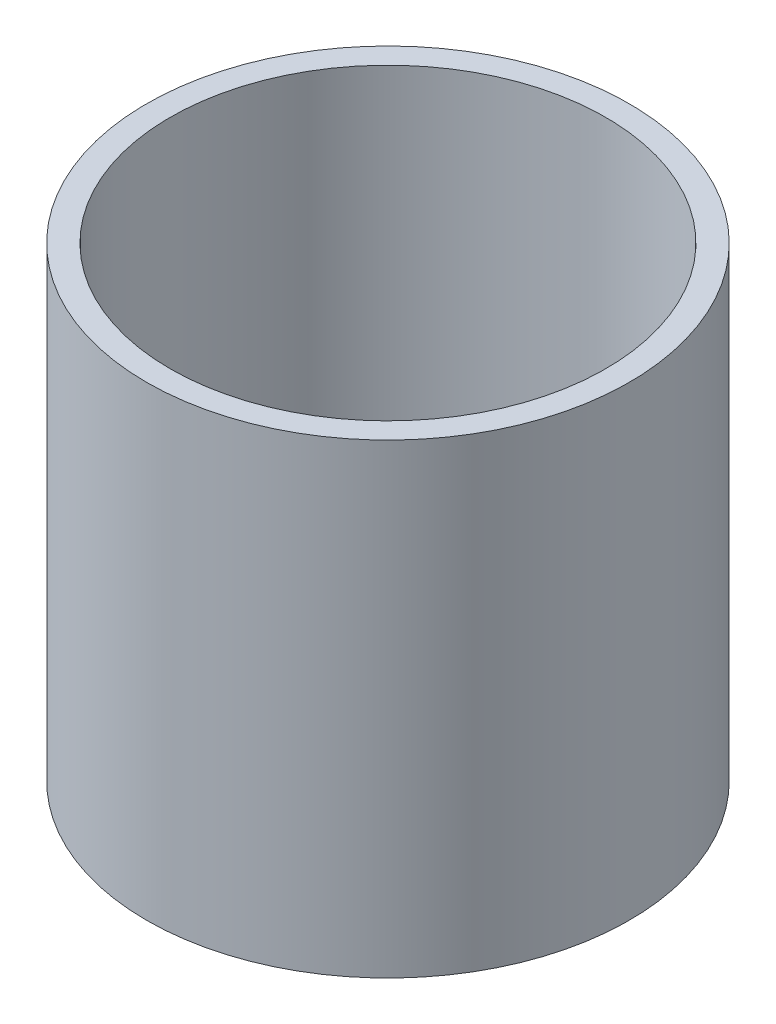
ISO-10303-21;
HEADER;
FILE_DESCRIPTION(('STEP AP214'),'2;1');
FILE_NAME('part.step','',(''),(''),'','','');
FILE_SCHEMA(('AUTOMOTIVE_DESIGN { 1 0 10303 214 1 1 1 1 }'));
ENDSEC;
DATA;
#1=APPLICATION_CONTEXT('core data for automotive mechanical design processes');
#2=APPLICATION_PROTOCOL_DEFINITION('international standard','automotive_design',2000,#1);
#3=PRODUCT_CONTEXT('',#1,'mechanical');
#4=PRODUCT('Part','Part','',(#3));
#5=PRODUCT_RELATED_PRODUCT_CATEGORY('part','',(#4));
#6=PRODUCT_DEFINITION_FORMATION('','',#4);
#7=PRODUCT_DEFINITION_CONTEXT('part definition',#1,'design');
#8=PRODUCT_DEFINITION('design','',#6,#7);
#9=PRODUCT_DEFINITION_SHAPE('','',#8);
#10=(LENGTH_UNIT() NAMED_UNIT(*) SI_UNIT(.MILLI.,.METRE.));
#11=(NAMED_UNIT(*) PLANE_ANGLE_UNIT() SI_UNIT($,.RADIAN.));
#12=(NAMED_UNIT(*) SI_UNIT($,.STERADIAN.) SOLID_ANGLE_UNIT());
#13=UNCERTAINTY_MEASURE_WITH_UNIT(LENGTH_MEASURE(1.E-05),#10,'distance_accuracy_value','');
#14=(GEOMETRIC_REPRESENTATION_CONTEXT(3) GLOBAL_UNCERTAINTY_ASSIGNED_CONTEXT((#13)) GLOBAL_UNIT_ASSIGNED_CONTEXT((#10,
#11,#12)) REPRESENTATION_CONTEXT('',''));
#15=CARTESIAN_POINT('',(0.,0.,0.));
#16=DIRECTION('',(0.,0.,1.));
#17=DIRECTION('',(1.,0.,0.));
#18=AXIS2_PLACEMENT_3D('',#15,#16,#17);
#19=CARTESIAN_POINT('',(0.,82.0479972284988,0.));
#20=DIRECTION('',(0.,-1.,0.));
#21=DIRECTION('',(0.,0.,-1.));
#22=AXIS2_PLACEMENT_3D('',#19,#20,#21);
#23=CYLINDRICAL_SURFACE('',#22,42.5);
#24=CARTESIAN_POINT('',(0.,82.0479972284988,0.));
#25=DIRECTION('',(0.,1.,0.));
#26=DIRECTION('',(0.,0.,1.));
#27=AXIS2_PLACEMENT_3D('',#24,#25,#26);
#28=CIRCLE('',#27,42.5);
#29=CARTESIAN_POINT('',(0.,82.0479972284988,42.5));
#30=VERTEX_POINT('',#29);
#31=EDGE_CURVE('E10',#30,#30,#28,.T.);
#32=ORIENTED_EDGE('',*,*,#31,.F.);
#33=EDGE_LOOP('',(#32));
#34=FACE_BOUND('',#33,.T.);
#35=CARTESIAN_POINT('',(0.,0.,0.));
#36=DIRECTION('',(0.,1.,0.));
#37=DIRECTION('',(0.,0.,1.));
#38=AXIS2_PLACEMENT_3D('',#35,#36,#37);
#39=CIRCLE('',#38,42.5);
#40=CARTESIAN_POINT('',(0.,0.,42.5));
#41=VERTEX_POINT('',#40);
#42=EDGE_CURVE('E37',#41,#41,#39,.T.);
#43=ORIENTED_EDGE('',*,*,#42,.T.);
#44=EDGE_LOOP('',(#43));
#45=FACE_BOUND('',#44,.T.);
#46=ADVANCED_FACE('F40',(#34,#45),#23,.T.);
#47=CARTESIAN_POINT('',(0.,82.0479972284988,0.));
#48=DIRECTION('',(0.,1.,0.));
#49=DIRECTION('',(0.,0.,1.));
#50=AXIS2_PLACEMENT_3D('',#47,#48,#49);
#51=PLANE('',#50);
#52=CARTESIAN_POINT('',(0.,82.0479972284988,0.));
#53=DIRECTION('',(0.,1.,0.));
#54=DIRECTION('',(0.,0.,1.));
#55=AXIS2_PLACEMENT_3D('',#52,#53,#54);
#56=CIRCLE('',#55,38.356586565251);
#57=CARTESIAN_POINT('',(0.,82.0479972284988,38.356586565251));
#58=VERTEX_POINT('',#57);
#59=EDGE_CURVE('E50',#58,#58,#56,.T.);
#60=ORIENTED_EDGE('',*,*,#59,.F.);
#61=EDGE_LOOP('',(#60));
#62=FACE_BOUND('',#61,.T.);
#63=ORIENTED_EDGE('',*,*,#31,.T.);
#64=EDGE_LOOP('',(#63));
#65=FACE_BOUND('',#64,.T.);
#66=ADVANCED_FACE('F59',(#62,#65),#51,.T.);
#67=CARTESIAN_POINT('',(0.,0.,0.));
#68=DIRECTION('',(0.,1.,0.));
#69=DIRECTION('',(0.,0.,1.));
#70=AXIS2_PLACEMENT_3D('',#67,#68,#69);
#71=PLANE('',#70);
#72=CARTESIAN_POINT('',(0.,0.,0.));
#73=DIRECTION('',(0.,1.,0.));
#74=DIRECTION('',(0.,0.,1.));
#75=AXIS2_PLACEMENT_3D('',#72,#73,#74);
#76=CIRCLE('',#75,38.356586565251);
#77=CARTESIAN_POINT('',(0.,0.,38.356586565251));
#78=VERTEX_POINT('',#77);
#79=EDGE_CURVE('E47',#78,#78,#76,.T.);
#80=ORIENTED_EDGE('',*,*,#79,.T.);
#81=EDGE_LOOP('',(#80));
#82=FACE_BOUND('',#81,.T.);
#83=ORIENTED_EDGE('',*,*,#42,.F.);
#84=EDGE_LOOP('',(#83));
#85=FACE_BOUND('',#84,.T.);
#86=ADVANCED_FACE('F58',(#82,#85),#71,.F.);
#87=CARTESIAN_POINT('',(0.,82.0479972284988,0.));
#88=DIRECTION('',(0.,-1.,0.));
#89=DIRECTION('',(0.,0.,-1.));
#90=AXIS2_PLACEMENT_3D('',#87,#88,#89);
#91=CYLINDRICAL_SURFACE('',#90,38.356586565251);
#92=ORIENTED_EDGE('',*,*,#59,.T.);
#93=EDGE_LOOP('',(#92));
#94=FACE_BOUND('',#93,.T.);
#95=ORIENTED_EDGE('',*,*,#79,.F.);
#96=EDGE_LOOP('',(#95));
#97=FACE_BOUND('',#96,.T.);
#98=ADVANCED_FACE('F54',(#94,#97),#91,.F.);
#99=CLOSED_SHELL('',(#46,#66,#86,#98));
#100=MANIFOLD_SOLID_BREP('B2',#99);
#101=ADVANCED_BREP_SHAPE_REPRESENTATION('',(#18,#100),#14);
#102=SHAPE_DEFINITION_REPRESENTATION(#9,#101);
ENDSEC;
END-ISO-10303-21;
